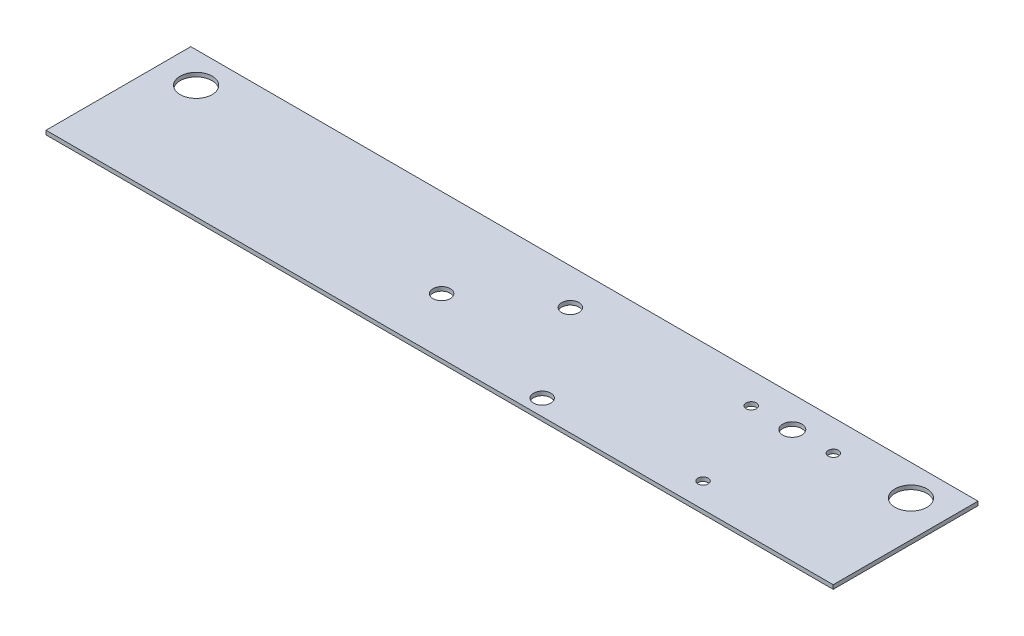
ISO-10303-21;
HEADER;
FILE_DESCRIPTION(('STEP AP214'),'2;1');
FILE_NAME('part.step','',(''),(''),'','','');
FILE_SCHEMA(('AUTOMOTIVE_DESIGN { 1 0 10303 214 1 1 1 1 }'));
ENDSEC;
DATA;
#1=APPLICATION_CONTEXT('core data for automotive mechanical design processes');
#2=APPLICATION_PROTOCOL_DEFINITION('international standard','automotive_design',2000,#1);
#3=PRODUCT_CONTEXT('',#1,'mechanical');
#4=PRODUCT('Part','Part','',(#3));
#5=PRODUCT_RELATED_PRODUCT_CATEGORY('part','',(#4));
#6=PRODUCT_DEFINITION_FORMATION('','',#4);
#7=PRODUCT_DEFINITION_CONTEXT('part definition',#1,'design');
#8=PRODUCT_DEFINITION('design','',#6,#7);
#9=PRODUCT_DEFINITION_SHAPE('','',#8);
#10=(LENGTH_UNIT() NAMED_UNIT(*) SI_UNIT(.MILLI.,.METRE.));
#11=(NAMED_UNIT(*) PLANE_ANGLE_UNIT() SI_UNIT($,.RADIAN.));
#12=(NAMED_UNIT(*) SI_UNIT($,.STERADIAN.) SOLID_ANGLE_UNIT());
#13=UNCERTAINTY_MEASURE_WITH_UNIT(LENGTH_MEASURE(1.E-05),#10,'distance_accuracy_value','');
#14=(GEOMETRIC_REPRESENTATION_CONTEXT(3) GLOBAL_UNCERTAINTY_ASSIGNED_CONTEXT((#13)) GLOBAL_UNIT_ASSIGNED_CONTEXT((#10,
#11,#12)) REPRESENTATION_CONTEXT('',''));
#15=CARTESIAN_POINT('',(0.,0.,0.));
#16=DIRECTION('',(0.,0.,1.));
#17=DIRECTION('',(1.,0.,0.));
#18=AXIS2_PLACEMENT_3D('',#15,#16,#17);
#19=CARTESIAN_POINT('',(0.,-1.,0.));
#20=DIRECTION('',(0.,1.,0.));
#21=DIRECTION('',(0.,0.,1.));
#22=AXIS2_PLACEMENT_3D('',#19,#20,#21);
#23=PLANE('',#22);
#24=CARTESIAN_POINT('',(-13.5,-0.999999999999999,3.5));
#25=DIRECTION('',(0.,1.,0.));
#26=DIRECTION('',(0.,0.,1.));
#27=AXIS2_PLACEMENT_3D('',#24,#25,#26);
#28=CIRCLE('',#27,2.15);
#29=CARTESIAN_POINT('',(-13.5,-0.999999999999999,5.65));
#30=VERTEX_POINT('',#29);
#31=EDGE_CURVE('E152',#30,#30,#28,.T.);
#32=ORIENTED_EDGE('',*,*,#31,.T.);
#33=EDGE_LOOP('',(#32));
#34=FACE_BOUND('',#33,.T.);
#35=CARTESIAN_POINT('',(5.49999999999999,-0.999999999999999,-9.50000000000001));
#36=DIRECTION('',(0.,1.,0.));
#37=DIRECTION('',(0.,0.,1.));
#38=AXIS2_PLACEMENT_3D('',#35,#36,#37);
#39=CIRCLE('',#38,2.15);
#40=CARTESIAN_POINT('',(5.49999999999999,-0.999999999999999,-7.35));
#41=VERTEX_POINT('',#40);
#42=EDGE_CURVE('E158',#41,#41,#39,.T.);
#43=ORIENTED_EDGE('',*,*,#42,.T.);
#44=EDGE_LOOP('',(#43));
#45=FACE_BOUND('',#44,.T.);
#46=CARTESIAN_POINT('',(21.5,-0.999999999999999,13.5));
#47=DIRECTION('',(0.,1.,0.));
#48=DIRECTION('',(0.,0.,1.));
#49=AXIS2_PLACEMENT_3D('',#46,#47,#48);
#50=CIRCLE('',#49,2.15);
#51=CARTESIAN_POINT('',(21.5,-0.999999999999999,15.65));
#52=VERTEX_POINT('',#51);
#53=EDGE_CURVE('E164',#52,#52,#50,.T.);
#54=ORIENTED_EDGE('',*,*,#53,.T.);
#55=EDGE_LOOP('',(#54));
#56=FACE_BOUND('',#55,.T.);
#57=DIRECTION('',(-1.,0.,0.));
#58=VECTOR('',#57,1.);
#59=CARTESIAN_POINT('',(37.5,-1.,-18.5));
#60=LINE('',#59,#58);
#61=CARTESIAN_POINT('',(97.8561944901924,-0.999999999999578,-18.5));
#62=VERTEX_POINT('',#61);
#63=CARTESIAN_POINT('',(-97.8561944901924,-0.999999999999578,-18.5));
#64=VERTEX_POINT('',#63);
#65=EDGE_CURVE('E12',#62,#64,#60,.T.);
#66=ORIENTED_EDGE('',*,*,#65,.F.);
#67=DIRECTION('',(0.,0.,1.));
#68=VECTOR('',#67,1.);
#69=CARTESIAN_POINT('',(97.8561944901924,-0.999999999999578,18.5));
#70=LINE('',#69,#68);
#71=CARTESIAN_POINT('',(97.8561944901924,-0.999999999999571,17.5));
#72=VERTEX_POINT('',#71);
#73=EDGE_CURVE('E87',#62,#72,#70,.T.);
#74=ORIENTED_EDGE('',*,*,#73,.T.);
#75=DIRECTION('',(-1.,0.,0.));
#76=VECTOR('',#75,1.);
#77=CARTESIAN_POINT('',(0.,-1.,17.5));
#78=LINE('',#77,#76);
#79=CARTESIAN_POINT('',(-97.8561944901926,-0.999999999999571,17.5));
#80=VERTEX_POINT('',#79);
#81=EDGE_CURVE('E58',#72,#80,#78,.T.);
#82=ORIENTED_EDGE('',*,*,#81,.T.);
#83=DIRECTION('',(0.,0.,-1.));
#84=VECTOR('',#83,1.);
#85=CARTESIAN_POINT('',(-97.8561944901924,-0.999999999999578,18.5));
#86=LINE('',#85,#84);
#87=EDGE_CURVE('E89',#80,#64,#86,.T.);
#88=ORIENTED_EDGE('',*,*,#87,.T.);
#89=EDGE_LOOP('',(#66,#74,#82,#88));
#90=FACE_BOUND('',#89,.T.);
#91=CARTESIAN_POINT('',(-88.8561944901921,-0.99999999999964,-10.83));
#92=DIRECTION('',(0.,-1.,0.));
#93=DIRECTION('',(1.,0.,0.));
#94=AXIS2_PLACEMENT_3D('',#91,#92,#93);
#95=CIRCLE('',#94,3.975);
#96=CARTESIAN_POINT('',(-84.8811944901921,-0.999999999999668,-10.83));
#97=VERTEX_POINT('',#96);
#98=EDGE_CURVE('E140',#97,#97,#95,.T.);
#99=ORIENTED_EDGE('',*,*,#98,.F.);
#100=EDGE_LOOP('',(#99));
#101=FACE_BOUND('',#100,.T.);
#102=CARTESIAN_POINT('',(69.5661944901924,-0.999999999999779,-10.8254056693695));
#103=DIRECTION('',(0.,1.,0.));
#104=DIRECTION('',(-1.,0.,0.));
#105=AXIS2_PLACEMENT_3D('',#102,#103,#104);
#106=CIRCLE('',#105,1.27000000000002);
#107=CARTESIAN_POINT('',(68.2961944901923,-0.999999999999788,-10.8254056693695));
#108=VERTEX_POINT('',#107);
#109=EDGE_CURVE('E114',#108,#108,#106,.T.);
#110=ORIENTED_EDGE('',*,*,#109,.T.);
#111=EDGE_LOOP('',(#110));
#112=FACE_BOUND('',#111,.T.);
#113=CARTESIAN_POINT('',(59.3561944901923,-0.999999999999848,-10.8254056693695));
#114=DIRECTION('',(0.,1.,0.));
#115=DIRECTION('',(-1.,0.,0.));
#116=AXIS2_PLACEMENT_3D('',#113,#114,#115);
#117=CIRCLE('',#116,2.37489999999999);
#118=CARTESIAN_POINT('',(56.9812944901924,-0.999999999999865,-10.8254056693695));
#119=VERTEX_POINT('',#118);
#120=EDGE_CURVE('E111',#119,#119,#117,.T.);
#121=ORIENTED_EDGE('',*,*,#120,.T.);
#122=EDGE_LOOP('',(#121));
#123=FACE_BOUND('',#122,.T.);
#124=CARTESIAN_POINT('',(49.1461944901924,-0.999999999999918,-10.8254056693695));
#125=DIRECTION('',(0.,1.,0.));
#126=DIRECTION('',(-1.,0.,0.));
#127=AXIS2_PLACEMENT_3D('',#124,#125,#126);
#128=CIRCLE('',#127,1.27);
#129=CARTESIAN_POINT('',(47.8761944901923,-0.999999999999927,-10.8254056693695));
#130=VERTEX_POINT('',#129);
#131=EDGE_CURVE('E108',#130,#130,#128,.T.);
#132=ORIENTED_EDGE('',*,*,#131,.T.);
#133=EDGE_LOOP('',(#132));
#134=FACE_BOUND('',#133,.T.);
#135=CARTESIAN_POINT('',(59.3561944901923,-0.999999999999848,11.3445943306306));
#136=DIRECTION('',(0.,1.,0.));
#137=DIRECTION('',(-1.,0.,0.));
#138=AXIS2_PLACEMENT_3D('',#135,#136,#137);
#139=CIRCLE('',#138,1.27);
#140=CARTESIAN_POINT('',(58.0861944901923,-0.999999999999857,11.3445943306306));
#141=VERTEX_POINT('',#140);
#142=EDGE_CURVE('E102',#141,#141,#139,.T.);
#143=ORIENTED_EDGE('',*,*,#142,.T.);
#144=EDGE_LOOP('',(#143));
#145=FACE_BOUND('',#144,.T.);
#146=CARTESIAN_POINT('',(88.8561944901924,-0.99999999999964,-10.8254056693695));
#147=DIRECTION('',(0.,1.,0.));
#148=DIRECTION('',(-1.,0.,0.));
#149=AXIS2_PLACEMENT_3D('',#146,#147,#148);
#150=CIRCLE('',#149,3.975);
#151=CARTESIAN_POINT('',(84.8811944901924,-0.999999999999668,-10.8254056693695));
#152=VERTEX_POINT('',#151);
#153=EDGE_CURVE('E99',#152,#152,#150,.T.);
#154=ORIENTED_EDGE('',*,*,#153,.T.);
#155=EDGE_LOOP('',(#154));
#156=FACE_BOUND('',#155,.T.);
#157=ADVANCED_FACE('F41',(#34,#45,#56,#90,#101,#112,#123,#134,#145,#156),#23,.F.);
#158=CARTESIAN_POINT('',(0.,0.,0.));
#159=DIRECTION('',(0.,1.,0.));
#160=DIRECTION('',(0.,0.,1.));
#161=AXIS2_PLACEMENT_3D('',#158,#159,#160);
#162=PLANE('',#161);
#163=DIRECTION('',(-1.,0.,0.));
#164=VECTOR('',#163,1.);
#165=CARTESIAN_POINT('',(-36.5,0.,17.5));
#166=LINE('',#165,#164);
#167=CARTESIAN_POINT('',(97.8561944901924,4.30211422042248E-13,17.5));
#168=VERTEX_POINT('',#167);
#169=CARTESIAN_POINT('',(-97.8561944901926,4.23272528138341E-13,17.5));
#170=VERTEX_POINT('',#169);
#171=EDGE_CURVE('E80',#168,#170,#166,.T.);
#172=ORIENTED_EDGE('',*,*,#171,.F.);
#173=DIRECTION('',(0.,0.,1.));
#174=VECTOR('',#173,1.);
#175=CARTESIAN_POINT('',(97.8561944901924,4.23272528138341E-13,18.5));
#176=LINE('',#175,#174);
#177=CARTESIAN_POINT('',(97.8561944901924,4.23272528138341E-13,-18.5));
#178=VERTEX_POINT('',#177);
#179=EDGE_CURVE('E132',#178,#168,#176,.T.);
#180=ORIENTED_EDGE('',*,*,#179,.F.);
#181=DIRECTION('',(-1.,0.,0.));
#182=VECTOR('',#181,1.);
#183=CARTESIAN_POINT('',(37.5,0.,-18.5));
#184=LINE('',#183,#182);
#185=CARTESIAN_POINT('',(-97.8561944901923,4.23272528138341E-13,-18.5));
#186=VERTEX_POINT('',#185);
#187=EDGE_CURVE('E45',#178,#186,#184,.T.);
#188=ORIENTED_EDGE('',*,*,#187,.T.);
#189=DIRECTION('',(0.,0.,-1.));
#190=VECTOR('',#189,1.);
#191=CARTESIAN_POINT('',(-97.8561944901924,4.23272528138341E-13,18.5));
#192=LINE('',#191,#190);
#193=EDGE_CURVE('E145',#170,#186,#192,.T.);
#194=ORIENTED_EDGE('',*,*,#193,.F.);
#195=EDGE_LOOP('',(#172,#180,#188,#194));
#196=FACE_BOUND('',#195,.T.);
#197=CARTESIAN_POINT('',(-13.5,0.,3.5));
#198=DIRECTION('',(0.,1.,0.));
#199=DIRECTION('',(0.,0.,1.));
#200=AXIS2_PLACEMENT_3D('',#197,#198,#199);
#201=CIRCLE('',#200,2.15);
#202=CARTESIAN_POINT('',(-13.5,0.,5.65));
#203=VERTEX_POINT('',#202);
#204=EDGE_CURVE('E149',#203,#203,#201,.T.);
#205=ORIENTED_EDGE('',*,*,#204,.F.);
#206=EDGE_LOOP('',(#205));
#207=FACE_BOUND('',#206,.T.);
#208=CARTESIAN_POINT('',(5.49999999999999,0.,-9.50000000000001));
#209=DIRECTION('',(0.,1.,0.));
#210=DIRECTION('',(0.,0.,1.));
#211=AXIS2_PLACEMENT_3D('',#208,#209,#210);
#212=CIRCLE('',#211,2.15);
#213=CARTESIAN_POINT('',(5.49999999999999,0.,-7.35));
#214=VERTEX_POINT('',#213);
#215=EDGE_CURVE('E155',#214,#214,#212,.T.);
#216=ORIENTED_EDGE('',*,*,#215,.F.);
#217=EDGE_LOOP('',(#216));
#218=FACE_BOUND('',#217,.T.);
#219=CARTESIAN_POINT('',(21.5,0.,13.5));
#220=DIRECTION('',(0.,1.,0.));
#221=DIRECTION('',(0.,0.,1.));
#222=AXIS2_PLACEMENT_3D('',#219,#220,#221);
#223=CIRCLE('',#222,2.15);
#224=CARTESIAN_POINT('',(21.5,0.,15.65));
#225=VERTEX_POINT('',#224);
#226=EDGE_CURVE('E161',#225,#225,#223,.T.);
#227=ORIENTED_EDGE('',*,*,#226,.F.);
#228=EDGE_LOOP('',(#227));
#229=FACE_BOUND('',#228,.T.);
#230=CARTESIAN_POINT('',(-88.8561944901921,3.60822483003176E-13,-10.83));
#231=DIRECTION('',(0.,-1.,0.));
#232=DIRECTION('',(1.,0.,0.));
#233=AXIS2_PLACEMENT_3D('',#230,#231,#232);
#234=CIRCLE('',#233,3.975);
#235=CARTESIAN_POINT('',(-84.8811944901921,3.33152793047259E-13,-10.83));
#236=VERTEX_POINT('',#235);
#237=EDGE_CURVE('E134',#236,#236,#234,.T.);
#238=ORIENTED_EDGE('',*,*,#237,.T.);
#239=EDGE_LOOP('',(#238));
#240=FACE_BOUND('',#239,.T.);
#241=CARTESIAN_POINT('',(69.5661944901923,2.22044604925031E-13,-10.8254056693695));
#242=DIRECTION('',(0.,1.,0.));
#243=DIRECTION('',(-1.,0.,0.));
#244=AXIS2_PLACEMENT_3D('',#241,#242,#243);
#245=CIRCLE('',#244,1.27000000000002);
#246=CARTESIAN_POINT('',(68.2961944901923,2.13204225995719E-13,-10.8254056693695));
#247=VERTEX_POINT('',#246);
#248=EDGE_CURVE('E117',#247,#247,#245,.T.);
#249=ORIENTED_EDGE('',*,*,#248,.F.);
#250=EDGE_LOOP('',(#249));
#251=FACE_BOUND('',#250,.T.);
#252=CARTESIAN_POINT('',(59.3561944901923,1.52655665885959E-13,-10.8254056693695));
#253=DIRECTION('',(0.,1.,0.));
#254=DIRECTION('',(-1.,0.,0.));
#255=AXIS2_PLACEMENT_3D('',#252,#253,#254);
#256=CIRCLE('',#255,2.37489999999999);
#257=CARTESIAN_POINT('',(56.9812944901924,1.36124157288146E-13,-10.8254056693695));
#258=VERTEX_POINT('',#257);
#259=EDGE_CURVE('E120',#258,#258,#256,.T.);
#260=ORIENTED_EDGE('',*,*,#259,.F.);
#261=EDGE_LOOP('',(#260));
#262=FACE_BOUND('',#261,.T.);
#263=CARTESIAN_POINT('',(49.1461944901923,0.,-10.8254056693695));
#264=DIRECTION('',(0.,1.,0.));
#265=DIRECTION('',(-1.,0.,0.));
#266=AXIS2_PLACEMENT_3D('',#263,#264,#265);
#267=CIRCLE('',#266,1.27);
#268=CARTESIAN_POINT('',(47.8761944901923,0.,-10.8254056693695));
#269=VERTEX_POINT('',#268);
#270=EDGE_CURVE('E123',#269,#269,#267,.T.);
#271=ORIENTED_EDGE('',*,*,#270,.F.);
#272=EDGE_LOOP('',(#271));
#273=FACE_BOUND('',#272,.T.);
#274=CARTESIAN_POINT('',(59.3561944901923,1.52655665885959E-13,11.3445943306306));
#275=DIRECTION('',(0.,1.,0.));
#276=DIRECTION('',(-1.,0.,0.));
#277=AXIS2_PLACEMENT_3D('',#274,#275,#276);
#278=CIRCLE('',#277,1.27);
#279=CARTESIAN_POINT('',(58.0861944901923,1.43815286956647E-13,11.3445943306306));
#280=VERTEX_POINT('',#279);
#281=EDGE_CURVE('E126',#280,#280,#278,.T.);
#282=ORIENTED_EDGE('',*,*,#281,.F.);
#283=EDGE_LOOP('',(#282));
#284=FACE_BOUND('',#283,.T.);
#285=CARTESIAN_POINT('',(88.8561944901924,3.60822483003176E-13,-10.8254056693695));
#286=DIRECTION('',(0.,1.,0.));
#287=DIRECTION('',(-1.,0.,0.));
#288=AXIS2_PLACEMENT_3D('',#285,#286,#287);
#289=CIRCLE('',#288,3.975);
#290=CARTESIAN_POINT('',(84.8811944901923,3.33152793047259E-13,-10.8254056693695));
#291=VERTEX_POINT('',#290);
#292=EDGE_CURVE('E129',#291,#291,#289,.T.);
#293=ORIENTED_EDGE('',*,*,#292,.F.);
#294=EDGE_LOOP('',(#293));
#295=FACE_BOUND('',#294,.T.);
#296=ADVANCED_FACE('F43',(#196,#207,#218,#229,#240,#251,#262,#273,#284,#295),#162,.T.);
#297=CARTESIAN_POINT('',(37.5,-1.,-18.5));
#298=DIRECTION('',(0.,0.,-1.));
#299=DIRECTION('',(-1.,0.,0.));
#300=AXIS2_PLACEMENT_3D('',#297,#298,#299);
#301=PLANE('',#300);
#302=ORIENTED_EDGE('',*,*,#65,.T.);
#303=DIRECTION('',(0.,-1.,0.));
#304=VECTOR('',#303,1.);
#305=CARTESIAN_POINT('',(-97.8561944901923,4.23272528138341E-13,-18.5));
#306=LINE('',#305,#304);
#307=EDGE_CURVE('E143',#186,#64,#306,.T.);
#308=ORIENTED_EDGE('',*,*,#307,.F.);
#309=ORIENTED_EDGE('',*,*,#187,.F.);
#310=DIRECTION('',(0.,-1.,0.));
#311=VECTOR('',#310,1.);
#312=CARTESIAN_POINT('',(97.8561944901924,4.23272528138341E-13,-18.5));
#313=LINE('',#312,#311);
#314=EDGE_CURVE('E91',#178,#62,#313,.T.);
#315=ORIENTED_EDGE('',*,*,#314,.T.);
#316=EDGE_LOOP('',(#302,#308,#309,#315));
#317=FACE_BOUND('',#316,.T.);
#318=ADVANCED_FACE('F92',(#317),#301,.T.);
#319=CARTESIAN_POINT('',(21.5,-10.,13.5));
#320=DIRECTION('',(0.,1.,0.));
#321=DIRECTION('',(0.,0.,1.));
#322=AXIS2_PLACEMENT_3D('',#319,#320,#321);
#323=CYLINDRICAL_SURFACE('',#322,2.15);
#324=ORIENTED_EDGE('',*,*,#226,.T.);
#325=EDGE_LOOP('',(#324));
#326=FACE_BOUND('',#325,.T.);
#327=ORIENTED_EDGE('',*,*,#53,.F.);
#328=EDGE_LOOP('',(#327));
#329=FACE_BOUND('',#328,.T.);
#330=ADVANCED_FACE('F169',(#326,#329),#323,.F.);
#331=CARTESIAN_POINT('',(5.49999999999999,-10.,-9.50000000000001));
#332=DIRECTION('',(0.,1.,0.));
#333=DIRECTION('',(0.,0.,1.));
#334=AXIS2_PLACEMENT_3D('',#331,#332,#333);
#335=CYLINDRICAL_SURFACE('',#334,2.15);
#336=ORIENTED_EDGE('',*,*,#215,.T.);
#337=EDGE_LOOP('',(#336));
#338=FACE_BOUND('',#337,.T.);
#339=ORIENTED_EDGE('',*,*,#42,.F.);
#340=EDGE_LOOP('',(#339));
#341=FACE_BOUND('',#340,.T.);
#342=ADVANCED_FACE('F171',(#338,#341),#335,.F.);
#343=CARTESIAN_POINT('',(-13.5,-10.,3.5));
#344=DIRECTION('',(0.,1.,0.));
#345=DIRECTION('',(0.,0.,1.));
#346=AXIS2_PLACEMENT_3D('',#343,#344,#345);
#347=CYLINDRICAL_SURFACE('',#346,2.15);
#348=ORIENTED_EDGE('',*,*,#204,.T.);
#349=EDGE_LOOP('',(#348));
#350=FACE_BOUND('',#349,.T.);
#351=ORIENTED_EDGE('',*,*,#31,.F.);
#352=EDGE_LOOP('',(#351));
#353=FACE_BOUND('',#352,.T.);
#354=ADVANCED_FACE('F178',(#350,#353),#347,.F.);
#355=CARTESIAN_POINT('',(-36.5,-10.,17.5));
#356=DIRECTION('',(0.,0.,-1.));
#357=DIRECTION('',(-1.,0.,0.));
#358=AXIS2_PLACEMENT_3D('',#355,#356,#357);
#359=PLANE('',#358);
#360=ORIENTED_EDGE('',*,*,#81,.F.);
#361=DIRECTION('',(0.,-1.,0.));
#362=VECTOR('',#361,1.);
#363=CARTESIAN_POINT('',(97.8561944901924,-0.999999999999571,17.5));
#364=LINE('',#363,#362);
#365=EDGE_CURVE('E95',#72,#168,#364,.F.);
#366=ORIENTED_EDGE('',*,*,#365,.T.);
#367=ORIENTED_EDGE('',*,*,#171,.T.);
#368=DIRECTION('',(0.,1.,0.));
#369=VECTOR('',#368,1.);
#370=CARTESIAN_POINT('',(-97.8561944901926,4.23272528138341E-13,17.5));
#371=LINE('',#370,#369);
#372=EDGE_CURVE('E137',#170,#80,#371,.F.);
#373=ORIENTED_EDGE('',*,*,#372,.T.);
#374=EDGE_LOOP('',(#360,#366,#367,#373));
#375=FACE_BOUND('',#374,.T.);
#376=ADVANCED_FACE('F193',(#375),#359,.F.);
#377=CARTESIAN_POINT('',(-97.8561944901924,4.23272528138341E-13,18.5));
#378=DIRECTION('',(-1.,0.,0.));
#379=DIRECTION('',(0.,-1.,0.));
#380=AXIS2_PLACEMENT_3D('',#377,#378,#379);
#381=PLANE('',#380);
#382=ORIENTED_EDGE('',*,*,#87,.F.);
#383=ORIENTED_EDGE('',*,*,#372,.F.);
#384=ORIENTED_EDGE('',*,*,#193,.T.);
#385=ORIENTED_EDGE('',*,*,#307,.T.);
#386=EDGE_LOOP('',(#382,#383,#384,#385));
#387=FACE_BOUND('',#386,.T.);
#388=ADVANCED_FACE('F199',(#387),#381,.T.);
#389=CARTESIAN_POINT('',(-88.8561944901921,-0.99999999999964,-10.83));
#390=DIRECTION('',(0.,-1.,0.));
#391=DIRECTION('',(1.,0.,0.));
#392=AXIS2_PLACEMENT_3D('',#389,#390,#391);
#393=CYLINDRICAL_SURFACE('',#392,3.975);
#394=ORIENTED_EDGE('',*,*,#237,.F.);
#395=EDGE_LOOP('',(#394));
#396=FACE_BOUND('',#395,.T.);
#397=ORIENTED_EDGE('',*,*,#98,.T.);
#398=EDGE_LOOP('',(#397));
#399=FACE_BOUND('',#398,.T.);
#400=ADVANCED_FACE('F203',(#396,#399),#393,.F.);
#401=CARTESIAN_POINT('',(97.8561944901924,4.23272528138341E-13,18.5));
#402=DIRECTION('',(1.,0.,0.));
#403=DIRECTION('',(0.,1.,0.));
#404=AXIS2_PLACEMENT_3D('',#401,#402,#403);
#405=PLANE('',#404);
#406=ORIENTED_EDGE('',*,*,#179,.T.);
#407=ORIENTED_EDGE('',*,*,#365,.F.);
#408=ORIENTED_EDGE('',*,*,#73,.F.);
#409=ORIENTED_EDGE('',*,*,#314,.F.);
#410=EDGE_LOOP('',(#406,#407,#408,#409));
#411=FACE_BOUND('',#410,.T.);
#412=ADVANCED_FACE('F98',(#411),#405,.T.);
#413=CARTESIAN_POINT('',(88.8561944901924,-2.99999999999964,-10.8254056693695));
#414=DIRECTION('',(0.,1.,0.));
#415=DIRECTION('',(-1.,0.,0.));
#416=AXIS2_PLACEMENT_3D('',#413,#414,#415);
#417=CYLINDRICAL_SURFACE('',#416,3.975);
#418=ORIENTED_EDGE('',*,*,#292,.T.);
#419=EDGE_LOOP('',(#418));
#420=FACE_BOUND('',#419,.T.);
#421=ORIENTED_EDGE('',*,*,#153,.F.);
#422=EDGE_LOOP('',(#421));
#423=FACE_BOUND('',#422,.T.);
#424=ADVANCED_FACE('F225',(#420,#423),#417,.F.);
#425=CARTESIAN_POINT('',(59.3561944901924,-2.99999999999985,11.3445943306306));
#426=DIRECTION('',(0.,1.,0.));
#427=DIRECTION('',(-1.,0.,0.));
#428=AXIS2_PLACEMENT_3D('',#425,#426,#427);
#429=CYLINDRICAL_SURFACE('',#428,1.27);
#430=ORIENTED_EDGE('',*,*,#281,.T.);
#431=EDGE_LOOP('',(#430));
#432=FACE_BOUND('',#431,.T.);
#433=ORIENTED_EDGE('',*,*,#142,.F.);
#434=EDGE_LOOP('',(#433));
#435=FACE_BOUND('',#434,.T.);
#436=ADVANCED_FACE('F221',(#432,#435),#429,.F.);
#437=CARTESIAN_POINT('',(49.1461944901924,-2.99999999999992,-10.8254056693695));
#438=DIRECTION('',(0.,1.,0.));
#439=DIRECTION('',(-1.,0.,0.));
#440=AXIS2_PLACEMENT_3D('',#437,#438,#439);
#441=CYLINDRICAL_SURFACE('',#440,1.27);
#442=ORIENTED_EDGE('',*,*,#270,.T.);
#443=EDGE_LOOP('',(#442));
#444=FACE_BOUND('',#443,.T.);
#445=ORIENTED_EDGE('',*,*,#131,.F.);
#446=EDGE_LOOP('',(#445));
#447=FACE_BOUND('',#446,.T.);
#448=ADVANCED_FACE('F217',(#444,#447),#441,.F.);
#449=CARTESIAN_POINT('',(59.3561944901924,-2.99999999999985,-10.8254056693695));
#450=DIRECTION('',(0.,1.,0.));
#451=DIRECTION('',(-1.,0.,0.));
#452=AXIS2_PLACEMENT_3D('',#449,#450,#451);
#453=CYLINDRICAL_SURFACE('',#452,2.37489999999999);
#454=ORIENTED_EDGE('',*,*,#259,.T.);
#455=EDGE_LOOP('',(#454));
#456=FACE_BOUND('',#455,.T.);
#457=ORIENTED_EDGE('',*,*,#120,.F.);
#458=EDGE_LOOP('',(#457));
#459=FACE_BOUND('',#458,.T.);
#460=ADVANCED_FACE('F213',(#456,#459),#453,.F.);
#461=CARTESIAN_POINT('',(69.5661944901924,-2.99999999999978,-10.8254056693695));
#462=DIRECTION('',(0.,1.,0.));
#463=DIRECTION('',(-1.,0.,0.));
#464=AXIS2_PLACEMENT_3D('',#461,#462,#463);
#465=CYLINDRICAL_SURFACE('',#464,1.27000000000002);
#466=ORIENTED_EDGE('',*,*,#248,.T.);
#467=EDGE_LOOP('',(#466));
#468=FACE_BOUND('',#467,.T.);
#469=ORIENTED_EDGE('',*,*,#109,.F.);
#470=EDGE_LOOP('',(#469));
#471=FACE_BOUND('',#470,.T.);
#472=ADVANCED_FACE('F210',(#468,#471),#465,.F.);
#473=CLOSED_SHELL('',(#157,#296,#318,#330,#342,#354,#376,#388,#400,#412,#424,#436,#448,#460,#472));
#474=MANIFOLD_SOLID_BREP('B2',#473);
#475=ADVANCED_BREP_SHAPE_REPRESENTATION('',(#18,#474),#14);
#476=SHAPE_DEFINITION_REPRESENTATION(#9,#475);
ENDSEC;
END-ISO-10303-21;
